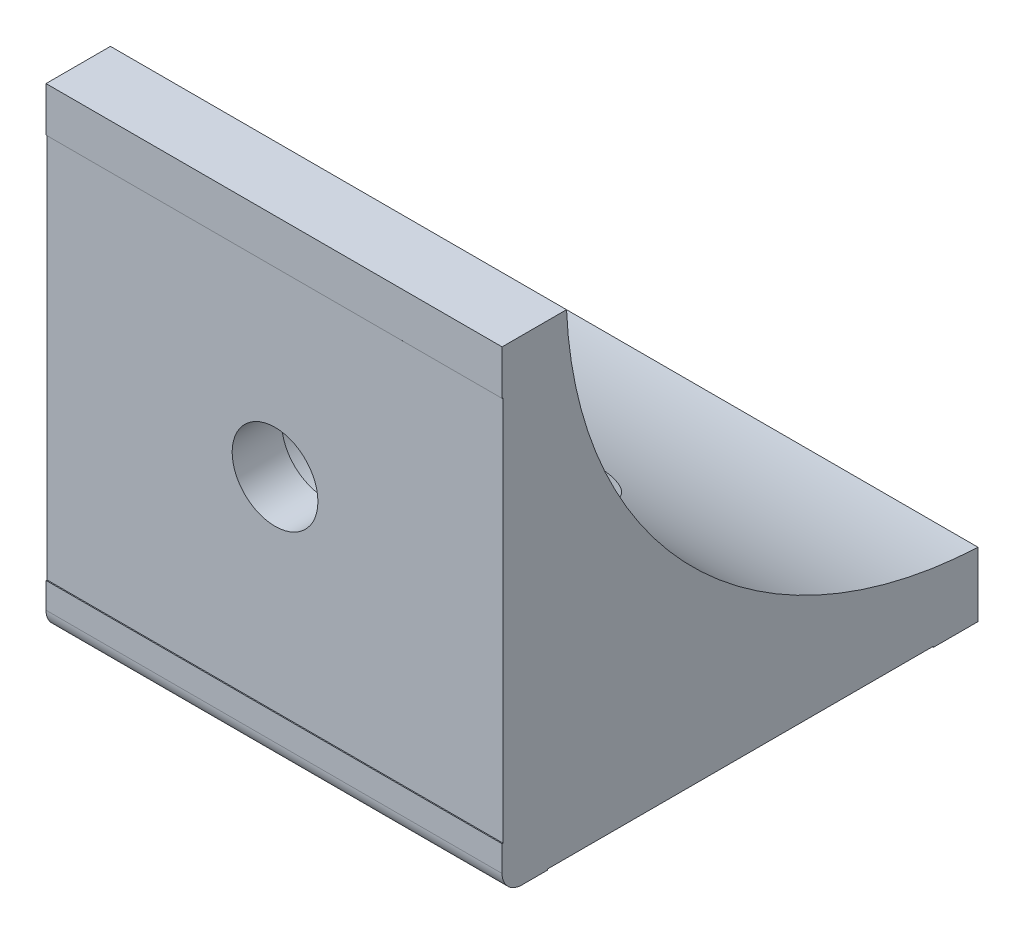
ISO-10303-21;
HEADER;
FILE_DESCRIPTION(('STEP AP214'),'2;1');
FILE_NAME('part.step','',(''),(''),'','','');
FILE_SCHEMA(('AUTOMOTIVE_DESIGN { 1 0 10303 214 1 1 1 1 }'));
ENDSEC;
DATA;
#1=APPLICATION_CONTEXT('core data for automotive mechanical design processes');
#2=APPLICATION_PROTOCOL_DEFINITION('international standard','automotive_design',2000,#1);
#3=PRODUCT_CONTEXT('',#1,'mechanical');
#4=PRODUCT('Part','Part','',(#3));
#5=PRODUCT_RELATED_PRODUCT_CATEGORY('part','',(#4));
#6=PRODUCT_DEFINITION_FORMATION('','',#4);
#7=PRODUCT_DEFINITION_CONTEXT('part definition',#1,'design');
#8=PRODUCT_DEFINITION('design','',#6,#7);
#9=PRODUCT_DEFINITION_SHAPE('','',#8);
#10=(LENGTH_UNIT() NAMED_UNIT(*) SI_UNIT(.MILLI.,.METRE.));
#11=(NAMED_UNIT(*) PLANE_ANGLE_UNIT() SI_UNIT($,.RADIAN.));
#12=(NAMED_UNIT(*) SI_UNIT($,.STERADIAN.) SOLID_ANGLE_UNIT());
#13=UNCERTAINTY_MEASURE_WITH_UNIT(LENGTH_MEASURE(1.E-05),#10,'distance_accuracy_value','');
#14=(GEOMETRIC_REPRESENTATION_CONTEXT(3) GLOBAL_UNCERTAINTY_ASSIGNED_CONTEXT((#13)) GLOBAL_UNIT_ASSIGNED_CONTEXT((#10,
#11,#12)) REPRESENTATION_CONTEXT('',''));
#15=CARTESIAN_POINT('',(0.,0.,0.));
#16=DIRECTION('',(0.,0.,1.));
#17=DIRECTION('',(1.,0.,0.));
#18=AXIS2_PLACEMENT_3D('',#15,#16,#17);
#19=CARTESIAN_POINT('',(23.,0.,0.));
#20=DIRECTION('',(0.,0.,-1.));
#21=DIRECTION('',(-1.,0.,0.));
#22=AXIS2_PLACEMENT_3D('',#19,#20,#21);
#23=PLANE('',#22);
#24=CARTESIAN_POINT('',(0.,25.,0.));
#25=DIRECTION('',(0.,0.,-1.));
#26=DIRECTION('',(0.,1.,0.));
#27=AXIS2_PLACEMENT_3D('',#24,#25,#26);
#28=CIRCLE('',#27,4.325);
#29=CARTESIAN_POINT('',(0.,29.325,0.));
#30=VERTEX_POINT('',#29);
#31=EDGE_CURVE('E213',#30,#30,#28,.T.);
#32=ORIENTED_EDGE('',*,*,#31,.T.);
#33=EDGE_LOOP('',(#32));
#34=FACE_BOUND('',#33,.T.);
#35=DIRECTION('',(-1.,0.,0.));
#36=VECTOR('',#35,1.);
#37=CARTESIAN_POINT('',(-23.,4.5,0.));
#38=LINE('',#37,#36);
#39=CARTESIAN_POINT('',(23.,4.5,0.));
#40=VERTEX_POINT('',#39);
#41=CARTESIAN_POINT('',(-23.,4.5,0.));
#42=VERTEX_POINT('',#41);
#43=EDGE_CURVE('E166',#40,#42,#38,.T.);
#44=ORIENTED_EDGE('',*,*,#43,.F.);
#45=DIRECTION('',(0.,-1.,0.));
#46=VECTOR('',#45,1.);
#47=CARTESIAN_POINT('',(23.,0.,0.));
#48=LINE('',#47,#46);
#49=CARTESIAN_POINT('',(23.,43.4,0.));
#50=VERTEX_POINT('',#49);
#51=EDGE_CURVE('E271',#50,#40,#48,.T.);
#52=ORIENTED_EDGE('',*,*,#51,.F.);
#53=DIRECTION('',(1.,0.,0.));
#54=VECTOR('',#53,1.);
#55=CARTESIAN_POINT('',(-23.,43.4,0.));
#56=LINE('',#55,#54);
#57=CARTESIAN_POINT('',(-23.,43.4,0.));
#58=VERTEX_POINT('',#57);
#59=EDGE_CURVE('E126',#58,#50,#56,.T.);
#60=ORIENTED_EDGE('',*,*,#59,.F.);
#61=DIRECTION('',(0.,-1.,0.));
#62=VECTOR('',#61,1.);
#63=CARTESIAN_POINT('',(-23.,0.,0.));
#64=LINE('',#63,#62);
#65=EDGE_CURVE('E311',#58,#42,#64,.T.);
#66=ORIENTED_EDGE('',*,*,#65,.T.);
#67=EDGE_LOOP('',(#44,#52,#60,#66));
#68=FACE_BOUND('',#67,.T.);
#69=ADVANCED_FACE('F16',(#34,#68),#23,.F.);
#70=CARTESIAN_POINT('',(23.,49.8370158421426,-49.8370158421426));
#71=DIRECTION('',(-1.,0.,0.));
#72=DIRECTION('',(0.,0.,1.));
#73=AXIS2_PLACEMENT_3D('',#70,#71,#72);
#74=CYLINDRICAL_SURFACE('',#73,43.4801837121609);
#75=CARTESIAN_POINT('',(-23.,49.8370158421426,-49.8370158421426));
#76=DIRECTION('',(-1.,0.,0.));
#77=DIRECTION('',(0.,0.,1.));
#78=AXIS2_PLACEMENT_3D('',#75,#76,#77);
#79=CIRCLE('',#78,43.4801837121609);
#80=CARTESIAN_POINT('',(-23.,6.4,-47.9));
#81=VERTEX_POINT('',#80);
#82=CARTESIAN_POINT('',(-23.,47.9,-6.4));
#83=VERTEX_POINT('',#82);
#84=EDGE_CURVE('E312',#81,#83,#79,.T.);
#85=ORIENTED_EDGE('',*,*,#84,.T.);
#86=DIRECTION('',(-1.,0.,0.));
#87=VECTOR('',#86,1.);
#88=CARTESIAN_POINT('',(23.,47.9,-6.4));
#89=LINE('',#88,#87);
#90=CARTESIAN_POINT('',(23.,47.9,-6.4));
#91=VERTEX_POINT('',#90);
#92=EDGE_CURVE('E308',#91,#83,#89,.T.);
#93=ORIENTED_EDGE('',*,*,#92,.F.);
#94=CARTESIAN_POINT('',(23.,49.8370158421426,-49.8370158421426));
#95=DIRECTION('',(-1.,0.,0.));
#96=DIRECTION('',(0.,0.,1.));
#97=AXIS2_PLACEMENT_3D('',#94,#95,#96);
#98=CIRCLE('',#97,43.4801837121609);
#99=CARTESIAN_POINT('',(23.,6.4,-47.9));
#100=VERTEX_POINT('',#99);
#101=EDGE_CURVE('E323',#100,#91,#98,.T.);
#102=ORIENTED_EDGE('',*,*,#101,.F.);
#103=DIRECTION('',(-1.,0.,0.));
#104=VECTOR('',#103,1.);
#105=CARTESIAN_POINT('',(23.,6.4,-47.9));
#106=LINE('',#105,#104);
#107=EDGE_CURVE('E259',#100,#81,#106,.T.);
#108=ORIENTED_EDGE('',*,*,#107,.T.);
#109=EDGE_LOOP('',(#85,#93,#102,#108));
#110=FACE_BOUND('',#109,.T.);
#111=CARTESIAN_POINT('',(0.,17.95,-20.2778447386389));
#112=CARTESIAN_POINT('',(-0.156852133625671,17.9500000287967,-20.2778446995712));
#113=CARTESIAN_POINT('',(-0.313704682230434,17.9552457500528,-20.2721828504309));
#114=CARTESIAN_POINT('',(-0.625909123536725,17.9760966773076,-20.2497138860527));
#115=CARTESIAN_POINT('',(-0.78126098688294,17.9917020855401,-20.232906553241));
#116=CARTESIAN_POINT('',(-1.08920305232275,18.032913687193,-20.1886369412381));
#117=CARTESIAN_POINT('',(-1.24179099094665,18.058527721062,-20.1611663088584));
#118=CARTESIAN_POINT('',(-1.54291865364216,18.1191934438134,-20.0963352428175));
#119=CARTESIAN_POINT('',(-1.69145823393064,18.1542454674195,-20.0589744583972));
#120=CARTESIAN_POINT('',(-1.98225084239021,18.2327510627156,-19.9756685272191));
#121=CARTESIAN_POINT('',(-2.12454880490887,18.2761252087994,-19.9298046625785));
#122=CARTESIAN_POINT('',(-2.40369044251626,18.3707834138897,-19.8302281470525));
#123=CARTESIAN_POINT('',(-2.54053196513077,18.4220705563428,-19.7765124369802));
#124=CARTESIAN_POINT('',(-2.94212672691639,18.5867272824805,-19.6050632335073));
#125=CARTESIAN_POINT('',(-3.19808082616225,18.7109284502344,-19.4769887622774));
#126=CARTESIAN_POINT('',(-3.80480687448833,19.050257256296,-19.1322115280365));
#127=CARTESIAN_POINT('',(-4.14021138915003,19.2800440136265,-18.902920291766));
#128=CARTESIAN_POINT('',(-4.60148146143606,19.6550678657208,-18.5383358020635));
#129=CARTESIAN_POINT('',(-4.7484602109213,19.7853583118506,-18.4131566129299));
#130=CARTESIAN_POINT('',(-5.0287547082574,20.0551107725313,-18.157386347025));
#131=CARTESIAN_POINT('',(-5.16207061348406,20.1945726814101,-18.0267953326143));
#132=CARTESIAN_POINT('',(-5.45186895657431,20.5233274263913,-17.7231934437043));
#133=CARTESIAN_POINT('',(-5.60386722922496,20.715347878082,-17.5488577267903));
#134=CARTESIAN_POINT('',(-5.8856502960148,21.1114650422608,-17.195944916415));
#135=CARTESIAN_POINT('',(-6.01542905320423,21.3155650165,-17.0173666852402));
#136=CARTESIAN_POINT('',(-6.25276826225128,21.7345188233822,-16.657922336038));
#137=CARTESIAN_POINT('',(-6.36032108471071,21.9493763173753,-16.47705545493));
#138=CARTESIAN_POINT('',(-6.55287075208026,22.3885148362486,-16.114809793375));
#139=CARTESIAN_POINT('',(-6.63786964056438,22.6127950052215,-15.9334310608122));
#140=CARTESIAN_POINT('',(-6.78535408209376,23.0712962686899,-15.5702856627198));
#141=CARTESIAN_POINT('',(-6.84766418910448,23.3055798046698,-15.3885264692206));
#142=CARTESIAN_POINT('',(-6.94808984231744,23.7811452847931,-15.0274321284259));
#143=CARTESIAN_POINT('',(-6.98620370037693,24.0224277160131,-14.8480971511192));
#144=CARTESIAN_POINT('',(-7.03723268433063,24.5101827552878,-14.4934346559095));
#145=CARTESIAN_POINT('',(-7.05017354291334,24.7566498025782,-14.3181032268848));
#146=CARTESIAN_POINT('',(-7.04982303237169,25.2531781518364,-13.9726505102806));
#147=CARTESIAN_POINT('',(-7.0365371467519,25.5032386916226,-13.8025281411397));
#148=CARTESIAN_POINT('',(-6.98749062659615,25.9592053911683,-13.4991932906903));
#149=CARTESIAN_POINT('',(-6.95625185708522,26.1648794144037,-13.364890462749));
#150=CARTESIAN_POINT('',(-6.87481413397947,26.5758528872967,-13.1014168228809));
#151=CARTESIAN_POINT('',(-6.82461178347573,26.78115226322,-12.9722469349916));
#152=CARTESIAN_POINT('',(-6.70470669035514,27.1896841293328,-12.719871806282));
#153=CARTESIAN_POINT('',(-6.63500745506929,27.3929169844641,-12.5966654973342));
#154=CARTESIAN_POINT('',(-6.47568818661435,27.795498939029,-12.3569841418899));
#155=CARTESIAN_POINT('',(-6.38607079074711,27.9948485488338,-12.2405082068157));
#156=CARTESIAN_POINT('',(-6.18588215581602,28.3891942175169,-12.014146887423));
#157=CARTESIAN_POINT('',(-6.07515098126832,28.5841434445664,-11.9043208347603));
#158=CARTESIAN_POINT('',(-5.83328209404338,28.9656394472225,-11.6930839115879));
#159=CARTESIAN_POINT('',(-5.70215467855844,29.152190401813,-11.5916688341313));
#160=CARTESIAN_POINT('',(-5.41985225445144,29.5144676500727,-11.3979393317964));
#161=CARTESIAN_POINT('',(-5.26868343139572,29.6901972592255,-11.3056221142255));
#162=CARTESIAN_POINT('',(-4.94702489170949,30.0283058902854,-11.1307164268389));
#163=CARTESIAN_POINT('',(-4.77653875346031,30.190687375243,-11.0481261609436));
#164=CARTESIAN_POINT('',(-4.44174902688932,30.478623350935,-10.9037221823287));
#165=CARTESIAN_POINT('',(-4.27972949193821,30.6061880319527,-10.8406092917689));
#166=CARTESIAN_POINT('',(-3.94317994729388,30.8477964432858,-10.7223892798581));
#167=CARTESIAN_POINT('',(-3.76865174666435,30.9618421224784,-10.6672810043162));
#168=CARTESIAN_POINT('',(-3.40845917002485,31.1748410693577,-10.5653523579114));
#169=CARTESIAN_POINT('',(-3.22280102657001,31.2738026758509,-10.5185274055296));
#170=CARTESIAN_POINT('',(-2.84178171167896,31.4553306887261,-10.433334652111));
#171=CARTESIAN_POINT('',(-2.64642140461869,31.5378985523798,-10.394966099335));
#172=CARTESIAN_POINT('',(-2.269305808803,31.67747700754,-10.3305255483192));
#173=CARTESIAN_POINT('',(-2.0883638802079,31.7362857958359,-10.303572490717));
#174=CARTESIAN_POINT('',(-1.72148357879722,31.8392459558259,-10.256593119413));
#175=CARTESIAN_POINT('',(-1.53554559132959,31.8833984544772,-10.2365662731332));
#176=CARTESIAN_POINT('',(-1.16015374529663,31.9565150238725,-10.203498736659));
#177=CARTESIAN_POINT('',(-0.970700945957483,31.9854835958773,-10.1904559760142));
#178=CARTESIAN_POINT('',(-0.589715201831114,32.0279064809689,-10.1713815467018));
#179=CARTESIAN_POINT('',(-0.398182294442085,32.0413610725163,-10.1653497521942));
#180=CARTESIAN_POINT('',(-0.0239903467593699,32.0523204360617,-10.1604356718422));
#181=CARTESIAN_POINT('',(0.158642802566594,32.0505756844296,-10.1612169867288));
#182=CARTESIAN_POINT('',(0.523084126086777,32.0329341194105,-10.1691302931826));
#183=CARTESIAN_POINT('',(0.704892318546231,32.0170376209069,-10.1762621434472));
#184=CARTESIAN_POINT('',(1.06635478197586,31.971267627016,-10.1968588822417));
#185=CARTESIAN_POINT('',(1.24600929438139,31.9413957136393,-10.2103230539566));
#186=CARTESIAN_POINT('',(1.60191344976246,31.8679973231088,-10.2435521216712));
#187=CARTESIAN_POINT('',(1.77816306505443,31.8244707349851,-10.2633170688766));
#188=CARTESIAN_POINT('',(2.12505610639665,31.7245100799772,-10.308968728204));
#189=CARTESIAN_POINT('',(2.29572548664944,31.6681499802141,-10.3348203869632));
#190=CARTESIAN_POINT('',(2.63141848599899,31.542953390693,-10.392644802074));
#191=CARTESIAN_POINT('',(2.79644018407773,31.4741127049218,-10.4246196172548));
#192=CARTESIAN_POINT('',(3.11970976545431,31.3246829328023,-10.4945870125192));
#193=CARTESIAN_POINT('',(3.27795881188217,31.2440958743259,-10.5325785539843));
#194=CARTESIAN_POINT('',(3.58678650686816,31.071961599928,-10.6144688159792));
#195=CARTESIAN_POINT('',(3.73736466831962,30.9804136892181,-10.6583679109999));
#196=CARTESIAN_POINT('',(4.0346531538191,30.7841844621767,-10.7534100172285));
#197=CARTESIAN_POINT('',(4.18109043063679,30.6791792927628,-10.8047382545526));
#198=CARTESIAN_POINT('',(4.4641575289208,30.459478064301,-10.9133415848928));
#199=CARTESIAN_POINT('',(4.6007869865006,30.344781646035,-10.9706168983626));
#200=CARTESIAN_POINT('',(4.86361187512162,30.1067806388883,-11.0908939085445));
#201=CARTESIAN_POINT('',(4.98980761500628,29.9834763050057,-11.1538954356418));
#202=CARTESIAN_POINT('',(5.23133406775435,29.7293123115308,-11.2853995360696));
#203=CARTESIAN_POINT('',(5.34666092036848,29.5984499940217,-11.3539040479865));
#204=CARTESIAN_POINT('',(5.57401534683741,29.3205738059315,-11.5012826084452));
#205=CARTESIAN_POINT('',(5.68519929879259,29.1730765451367,-11.5805483325842));
#206=CARTESIAN_POINT('',(5.89439995622114,28.8719766631422,-11.7447200763368));
#207=CARTESIAN_POINT('',(5.99241179710467,28.7183718133404,-11.829628162524));
#208=CARTESIAN_POINT('',(6.26645482861684,28.2503203414699,-12.09223553945));
#209=CARTESIAN_POINT('',(6.42261608165731,27.92848482095,-12.2778979203151));
#210=CARTESIAN_POINT('',(6.69750401260337,27.2362229856462,-12.689858279517));
#211=CARTESIAN_POINT('',(6.80965574687745,26.8645380479034,-12.9183668023995));
#212=CARTESIAN_POINT('',(6.9711130620304,26.1188176398894,-13.3929612933016));
#213=CARTESIAN_POINT('',(7.02038940779371,25.7447811573894,-13.6390553819494));
#214=CARTESIAN_POINT('',(7.06279930664877,24.9458921249165,-14.1827617731816));
#215=CARTESIAN_POINT('',(7.04622478170287,24.5219890942904,-14.4825072721807));
#216=CARTESIAN_POINT('',(6.94005690686496,23.6908553898329,-15.0926534167344));
#217=CARTESIAN_POINT('',(6.8503950088103,23.2836407446541,-15.4030638029169));
#218=CARTESIAN_POINT('',(6.65542800695635,22.6624751114756,-15.8936174332544));
#219=CARTESIAN_POINT('',(6.57314481960206,22.440238037673,-16.0727962598814));
#220=CARTESIAN_POINT('',(6.38650053575546,22.0048009128635,-16.4308262836361));
#221=CARTESIAN_POINT('',(6.28213547887723,21.7916024911844,-16.6096774161802));
#222=CARTESIAN_POINT('',(6.05163911123428,21.3755354172986,-16.9653644241815));
#223=CARTESIAN_POINT('',(5.92550698557504,21.1726671521908,-17.1422002239263));
#224=CARTESIAN_POINT('',(5.65152575530012,20.7785868010537,-17.4919480531474));
#225=CARTESIAN_POINT('',(5.5036827063409,20.5873714857347,-17.6648611612733));
#226=CARTESIAN_POINT('',(5.22195651857233,20.2598314367149,-17.9661154555677));
#227=CARTESIAN_POINT('',(5.09246371624649,20.1208643934035,-18.0957019685971));
#228=CARTESIAN_POINT('',(4.82014244701854,19.8516613955943,-18.3498891496752));
#229=CARTESIAN_POINT('',(4.67731407269458,19.7214253804948,-18.4744898523279));
#230=CARTESIAN_POINT('',(4.37833859693755,19.4709312640508,-18.7169643635958));
#231=CARTESIAN_POINT('',(4.22221374976518,19.3506571302328,-18.8348488817455));
#232=CARTESIAN_POINT('',(3.89633881099277,19.1211554872644,-19.0622139234961));
#233=CARTESIAN_POINT('',(3.72658782736494,19.0119287023824,-19.1716938959787));
#234=CARTESIAN_POINT('',(3.29133763498077,18.75828889916,-19.4283843349681));
#235=CARTESIAN_POINT('',(3.01788878043246,18.6209913679083,-19.569602746914));
#236=CARTESIAN_POINT('',(2.58718895349757,18.4400265532406,-19.7577355739897));
#237=CARTESIAN_POINT('',(2.4401891758267,18.3838651751663,-19.8165009875043));
#238=CARTESIAN_POINT('',(2.13978963335064,18.2807010431849,-19.9249622193799));
#239=CARTESIAN_POINT('',(1.98639316504553,18.2336936409465,-19.9746626400701));
#240=CARTESIAN_POINT('',(1.68460339353686,18.1525668028298,-20.060761333373));
#241=CARTESIAN_POINT('',(1.53658045341502,18.1177878267999,-20.0978348618041));
#242=CARTESIAN_POINT('',(1.23660557585795,18.0576167264864,-20.1621424660901));
#243=CARTESIAN_POINT('',(1.08465586476807,18.0322194028542,-20.1893819917977));
#244=CARTESIAN_POINT('',(0.777995827191417,17.9913529889788,-20.2332823291412));
#245=CARTESIAN_POINT('',(0.623287157433132,17.975878133887,-20.2499492832683));
#246=CARTESIAN_POINT('',(0.312385791396352,17.9552016469596,-20.2722304839075));
#247=CARTESIAN_POINT('',(0.156193101447803,17.9499999713243,-20.2778447775425));
#248=CARTESIAN_POINT('',(0.,17.95,-20.2778447386389));
#249=B_SPLINE_CURVE_WITH_KNOTS('',3,(#111,#112,#113,#114,#115,#116,#117,#118,#119,#120,#121,
#122,#123,#124,#125,#126,#127,#128,#129,#130,#131,#132,#133,#134,#135,#136,#137,#138,#139,#140,
#141,#142,#143,#144,#145,#146,#147,#148,#149,#150,#151,#152,#153,#154,#155,#156,#157,#158,#159,
#160,#161,#162,#163,#164,#165,#166,#167,#168,#169,#170,#171,#172,#173,#174,#175,#176,#177,#178,
#179,#180,#181,#182,#183,#184,#185,#186,#187,#188,#189,#190,#191,#192,#193,#194,#195,#196,#197,
#198,#199,#200,#201,#202,#203,#204,#205,#206,#207,#208,#209,#210,#211,#212,#213,#214,#215,#216,
#217,#218,#219,#220,#221,#222,#223,#224,#225,#226,#227,#228,#229,#230,#231,#232,#233,#234,#235,
#236,#237,#238,#239,#240,#241,#242,#243,#244,#245,#246,#247,#248),.UNSPECIFIED.,.T.,.F.,(4,2,2,
2,2,2,2,2,2,2,2,2,2,2,2,2,2,2,2,2,2,2,2,2,2,2,2,2,2,2,2,2,2,2,2,2,2,2,2,2,2,2,2,2,2,2,2,2,2,2,2,
2,2,2,2,2,2,2,2,2,2,2,2,2,2,2,2,2,4),(0.,0.470370238960469,0.940749660404657,1.41149830370167,
1.88226364456705,2.34874143476547,2.81540145795772,3.74830284823619,5.14055115500903,
5.83883949696847,6.53711979477233,7.43778002368517,8.33868457123552,9.23989785648399,
10.1410294564075,11.048988272704,11.9570104292184,12.8641038860849,13.771007707354,
14.5131413511259,15.2554079949239,15.9975411967658,16.7395761935298,17.487473006393,
18.2349934562911,18.982283726771,19.7294357932001,20.3755053334017,21.0214816237205,
21.667099498757,22.3126599578438,22.8884092228424,23.4641142068361,24.0396484269587,
24.6151723166448,25.1624467686232,25.7097090437759,26.2569093840763,26.8041141715246,
27.3482415306491,27.8925521675386,28.43676894671,28.981020241068,29.542488665156,
30.1039779099074,30.6654505283313,31.2271218165899,31.8294648022149,32.4320296312809,
33.6365329541953,34.9828963559621,36.3298855473162,37.8822966302984,39.4361653868781,
40.3266281815815,41.2172508164735,42.1079068008724,42.998314831818,43.6875909860844,
44.3768623556167,45.065001950456,45.7531866307856,46.7599160428425,47.2633580822032,
47.7665438063989,48.2354725401391,48.7041410004381,49.1725369220472,49.6409308466546),.UNSPECIFIED.);
#250=CARTESIAN_POINT('',(-3.84664199033898,19.0918830920368,-19.0918830920368));
#251=VERTEX_POINT('',#250);
#252=CARTESIAN_POINT('',(3.84664199033899,19.0918830920368,-19.0918830920368));
#253=VERTEX_POINT('',#252);
#254=EDGE_CURVE('E206',#251,#253,#249,.T.);
#255=ORIENTED_EDGE('',*,*,#254,.F.);
#256=CARTESIAN_POINT('',(0.,10.1614762355459,-32.05));
#257=CARTESIAN_POINT('',(0.183707570233541,10.1614765002818,-32.0499987505087));
#258=CARTESIAN_POINT('',(0.367452895787242,10.1646968068717,-32.0428108166061));
#259=CARTESIAN_POINT('',(0.733671539090991,10.1775746022229,-32.0141278614933));
#260=CARTESIAN_POINT('',(0.916144144047546,10.1872354447676,-31.9926253862736));
#261=CARTESIAN_POINT('',(1.27876464921499,10.2129991040001,-31.9354891844208));
#262=CARTESIAN_POINT('',(1.45890745016847,10.2291141756085,-31.8998285762627));
#263=CARTESIAN_POINT('',(1.81522131582155,10.267747038486,-31.8147651407949));
#264=CARTESIAN_POINT('',(1.99139221887985,10.2902650898265,-31.7653617552932));
#265=CARTESIAN_POINT('',(2.33815911060063,10.3415891323124,-31.6534677553645));
#266=CARTESIAN_POINT('',(2.50876619266579,10.3703816040233,-31.5910052907835));
#267=CARTESIAN_POINT('',(2.84366710223569,10.4342018238766,-31.4535896750908));
#268=CARTESIAN_POINT('',(3.0079607555849,10.4692297438734,-31.3786361797187));
#269=CARTESIAN_POINT('',(3.32908786283742,10.5453887573039,-31.217070026018));
#270=CARTESIAN_POINT('',(3.48592621880274,10.5865157650156,-31.1304651764001));
#271=CARTESIAN_POINT('',(3.79139461482677,10.6747723623659,-30.9463970605285));
#272=CARTESIAN_POINT('',(3.94002173095623,10.7219040707099,-30.8489299631545));
#273=CARTESIAN_POINT('',(4.23175430963142,10.8232270963472,-30.6415920069369));
#274=CARTESIAN_POINT('',(4.37463469694004,10.8775632986905,-30.5314754146525));
#275=CARTESIAN_POINT('',(4.65022137998255,10.9921706663957,-30.3018976887347));
#276=CARTESIAN_POINT('',(4.78292399409678,11.0524439615486,-30.1824332049504));
#277=CARTESIAN_POINT('',(5.03752145634532,11.1786666273633,-29.9353161083602));
#278=CARTESIAN_POINT('',(5.15941764459328,11.2446152922131,-29.8076645142378));
#279=CARTESIAN_POINT('',(5.39204433283001,11.3819539953322,-29.545230767352));
#280=CARTESIAN_POINT('',(5.50277061646725,11.4533460706267,-29.4104459510332));
#281=CARTESIAN_POINT('',(5.72089542709534,11.6070229780275,-29.124160079872));
#282=CARTESIAN_POINT('',(5.82736609630736,11.6897231546718,-28.9721740741668));
#283=CARTESIAN_POINT('',(6.02678939578838,11.8607113949627,-28.6625490772928));
#284=CARTESIAN_POINT('',(6.1197370241852,11.9490015089615,-28.5049080211852));
#285=CARTESIAN_POINT('',(6.37815730543464,12.2216457882312,-28.0254369726668));
#286=CARTESIAN_POINT('',(6.52332012702878,12.4138539604889,-27.6969088367289));
#287=CARTESIAN_POINT('',(6.77472104453422,12.8402015649167,-26.9907368358259));
#288=CARTESIAN_POINT('',(6.87399888814989,13.0765923027592,-26.6120120164315));
#289=CARTESIAN_POINT('',(7.00863073491224,13.5663857754743,-25.8542797088584));
#290=CARTESIAN_POINT('',(7.04395588612162,13.8197961352246,-25.475272170231));
#291=CARTESIAN_POINT('',(7.05544688624943,14.3789888598874,-24.66695632081));
#292=CARTESIAN_POINT('',(7.02162346061193,14.6868115302799,-24.2389292134322));
#293=CARTESIAN_POINT('',(6.87961296760577,15.3118824710497,-23.4019128542899));
#294=CARTESIAN_POINT('',(6.77134588283664,15.6291405318524,-22.9929445939085));
#295=CARTESIAN_POINT('',(6.54632077627984,16.1281009570364,-22.372137773809));
#296=CARTESIAN_POINT('',(6.45321898300773,16.3094494378527,-22.1511312018296));
#297=CARTESIAN_POINT('',(6.24455972714239,16.6711046197277,-21.718908290398));
#298=CARTESIAN_POINT('',(6.12899776517842,16.8514111045819,-21.5076939231033));
#299=CARTESIAN_POINT('',(5.87567126174323,17.2090600840378,-21.096501756221));
#300=CARTESIAN_POINT('',(5.7379136032994,17.3864034787561,-20.8965204990187));
#301=CARTESIAN_POINT('',(5.44011093693517,17.7360321639283,-20.5091925970141));
#302=CARTESIAN_POINT('',(5.28007394600832,17.9083192469627,-20.3218414432307));
#303=CARTESIAN_POINT('',(4.98424832558147,18.1991620015417,-20.0107738190471));
#304=CARTESIAN_POINT('',(4.85379708871086,18.3195269095115,-19.88366644126));
#305=CARTESIAN_POINT('',(4.58081804547171,18.5549526707605,-19.637877695929));
#306=CARTESIAN_POINT('',(4.43829066537176,18.6700137110367,-19.5191960312424));
#307=CARTESIAN_POINT('',(3.99266885973872,19.004827328594,-19.1775410824479));
#308=CARTESIAN_POINT('',(3.67093742066127,19.2148129395264,-18.9683185215351));
#309=CARTESIAN_POINT('',(3.06519862249298,19.5453020485189,-18.6444179095037));
#310=CARTESIAN_POINT('',(2.791952934094,19.6750412542413,-18.5191871326217));
#311=CARTESIAN_POINT('',(2.363301717107,19.845552403249,-18.3561536788473));
#312=CARTESIAN_POINT('',(2.21731742561657,19.8983653309969,-18.3059519203431));
#313=CARTESIAN_POINT('',(1.91959168567228,19.9948890960536,-18.2145828449638));
#314=CARTESIAN_POINT('',(1.76785110743076,20.0386013027411,-18.173414168837));
#315=CARTESIAN_POINT('',(1.48229409669536,20.1101239254412,-18.1062687540743));
#316=CARTESIAN_POINT('',(1.34914198919114,20.1393296031547,-18.0789461089418));
#317=CARTESIAN_POINT('',(1.08002013726251,20.1897418226315,-18.031879280349));
#318=CARTESIAN_POINT('',(0.944050889078033,20.2109497607712,-18.0121337739374));
#319=CARTESIAN_POINT('',(0.67020148947333,20.2448862583853,-17.9805756506983));
#320=CARTESIAN_POINT('',(0.532322204007256,20.2576185398182,-17.9687595517713));
#321=CARTESIAN_POINT('',(0.255571828890037,20.2743142827645,-17.9532710281419));
#322=CARTESIAN_POINT('',(0.116700726658411,20.2782776328514,-17.9495987069223));
#323=CARTESIAN_POINT('',(-0.161126718175452,20.277336345134,-17.9504712807862));
#324=CARTESIAN_POINT('',(-0.300083003681186,20.2724226775998,-17.9550245429584));
#325=CARTESIAN_POINT('',(-0.576894428567612,20.2538314696064,-17.9722745583743));
#326=CARTESIAN_POINT('',(-0.714749564469544,20.2401539014712,-17.9849713373348));
#327=CARTESIAN_POINT('',(-0.988413030669495,20.2043578503889,-18.0182705674418));
#328=CARTESIAN_POINT('',(-1.12422093588068,20.182237638839,-18.0388746375843));
#329=CARTESIAN_POINT('',(-1.39296632183071,20.1300404414016,-18.0876337933848));
#330=CARTESIAN_POINT('',(-1.52590260443653,20.0999602011359,-18.1157919675276));
#331=CARTESIAN_POINT('',(-1.78827511209352,20.0324260577844,-18.1792371795514));
#332=CARTESIAN_POINT('',(-1.91770805202301,19.9949654891656,-18.2145306624358));
#333=CARTESIAN_POINT('',(-2.17244397567826,19.913358457921,-18.291742780459));
#334=CARTESIAN_POINT('',(-2.29774565156021,19.8692099023454,-18.3336634897126));
#335=CARTESIAN_POINT('',(-2.66679675177403,19.7277905869096,-18.4685930709636));
#336=CARTESIAN_POINT('',(-2.90378353857502,19.6215218855227,-18.5707920164177));
#337=CARTESIAN_POINT('',(-3.48896105161065,19.3236417001209,-18.8608243932264));
#338=CARTESIAN_POINT('',(-3.82249391612924,19.1181496253825,-19.0640592929228));
#339=CARTESIAN_POINT('',(-4.28503597084641,18.7879416676196,-19.3984485728414));
#340=CARTESIAN_POINT('',(-4.4331453863274,18.6739961298071,-19.5150601814331));
#341=CARTESIAN_POINT('',(-4.71701221130314,18.4402218147256,-19.7571900107004));
#342=CARTESIAN_POINT('',(-4.85276979661199,18.3203931212339,-19.882708104557));
#343=CARTESIAN_POINT('',(-5.15446239781249,18.0363099350871,-20.1840691592976));
#344=CARTESIAN_POINT('',(-5.31574950467038,17.8703410823774,-20.3629470951754));
#345=CARTESIAN_POINT('',(-5.61717824013738,17.5330088767765,-20.7330599281004));
#346=CARTESIAN_POINT('',(-5.75731326522328,17.3616438593396,-20.9242986575932));
#347=CARTESIAN_POINT('',(-6.01655724841689,17.0155914763337,-21.3177394239709));
#348=CARTESIAN_POINT('',(-6.13566333102554,16.840903660017,-21.5199429552499));
#349=CARTESIAN_POINT('',(-6.35272926256588,16.4899738700133,-21.9340620531424));
#350=CARTESIAN_POINT('',(-6.45069100845322,16.3137320372222,-22.1459767464534));
#351=CARTESIAN_POINT('',(-6.62619696456099,15.9590813662686,-22.5809777842431));
#352=CARTESIAN_POINT('',(-6.70348465514557,15.7806716697361,-22.8041669755051));
#353=CARTESIAN_POINT('',(-6.83552400616859,15.4251852710439,-23.2581630955508));
#354=CARTESIAN_POINT('',(-6.89027509235276,15.2481086029639,-23.4889702182849));
#355=CARTESIAN_POINT('',(-6.97647662085874,14.8965590399237,-23.9569747824194));
#356=CARTESIAN_POINT('',(-7.00791956686252,14.7220870003217,-24.1941742543173));
#357=CARTESIAN_POINT('',(-7.04653042561597,14.3771102034411,-24.6733790967678));
#358=CARTESIAN_POINT('',(-7.05370055060257,14.2066050860222,-24.9153840273264));
#359=CARTESIAN_POINT('',(-7.04257395524861,13.8664736859077,-25.4087834017597));
#360=CARTESIAN_POINT('',(-7.02361284137509,13.6969845387308,-25.6602586956215));
#361=CARTESIAN_POINT('',(-6.95785028204802,13.3648932003485,-26.1642107962334));
#362=CARTESIAN_POINT('',(-6.91104561728311,13.2022918078442,-26.4166877154392));
#363=CARTESIAN_POINT('',(-6.78859203904216,12.8856905154295,-26.9194669971556));
#364=CARTESIAN_POINT('',(-6.71299157277978,12.7316766637227,-27.1697722937748));
#365=CARTESIAN_POINT('',(-6.5320588929746,12.4334304139695,-27.6653738487889));
#366=CARTESIAN_POINT('',(-6.42674002176222,12.2891936623695,-27.9106723021733));
#367=CARTESIAN_POINT('',(-6.22122425216319,12.0525515346757,-28.3219199105388));
#368=CARTESIAN_POINT('',(-6.1285694758544,11.9573429207254,-28.4900582578712));
#369=CARTESIAN_POINT('',(-5.92816965187785,11.7729850132588,-28.8205533180753));
#370=CARTESIAN_POINT('',(-5.82042765233153,11.6838345011945,-28.9829111905057));
#371=CARTESIAN_POINT('',(-5.59006084623252,11.5120871973575,-29.3002495728767));
#372=CARTESIAN_POINT('',(-5.46744307789771,11.4294873366108,-29.4552335237139));
#373=CARTESIAN_POINT('',(-5.20764097468752,11.2712193697173,-29.756312517539));
#374=CARTESIAN_POINT('',(-5.07045604884263,11.1955515450257,-29.9024071995229));
#375=CARTESIAN_POINT('',(-4.78139144715696,11.0511833335114,-30.18476792057));
#376=CARTESIAN_POINT('',(-4.62944167315373,10.982519706904,-30.3209811182582));
#377=CARTESIAN_POINT('',(-4.31228562143995,10.8529492286777,-30.5811064336896));
#378=CARTESIAN_POINT('',(-4.14708035297521,10.7920417874308,-30.7050194863361));
#379=CARTESIAN_POINT('',(-3.80443630434252,10.6782540184489,-30.9390082899295));
#380=CARTESIAN_POINT('',(-3.62699285500709,10.6253767793454,-31.0490787138457));
#381=CARTESIAN_POINT('',(-3.26128817492759,10.5279268376137,-31.2538308792473));
#382=CARTESIAN_POINT('',(-3.07302839217226,10.4833530267742,-31.3485146740824));
#383=CARTESIAN_POINT('',(-2.70517248404078,10.4064401196917,-31.5131639433297));
#384=CARTESIAN_POINT('',(-2.52639336817344,10.3733495446056,-31.584607803785));
#385=CARTESIAN_POINT('',(-2.16254675329436,10.3142633090446,-31.712904765848));
#386=CARTESIAN_POINT('',(-1.97747993917005,10.2882668786086,-31.7697594508481));
#387=CARTESIAN_POINT('',(-1.60292631383401,10.2434978333861,-31.8680809659738));
#388=CARTESIAN_POINT('',(-1.41345092652421,10.2247083662273,-31.9095836860996));
#389=CARTESIAN_POINT('',(-1.03124620057565,10.1943272432033,-31.9768649595714));
#390=CARTESIAN_POINT('',(-0.838518833403703,10.1827313767269,-32.0026527111613));
#391=CARTESIAN_POINT('',(-0.537814968712504,10.1703213256556,-32.0302805387283));
#392=CARTESIAN_POINT('',(-0.430417932509644,10.1670049071078,-32.0376721283451));
#393=CARTESIAN_POINT('',(-0.215351588378684,10.1625822837428,-32.0475322267891));
#394=CARTESIAN_POINT('',(-0.10768228027295,10.1614760803679,-32.0500007324035));
#395=CARTESIAN_POINT('',(0.,10.1614762355459,-32.05));
#396=B_SPLINE_CURVE_WITH_KNOTS('',3,(#256,#257,#258,#259,#260,#261,#262,#263,#264,#265,#266,
#267,#268,#269,#270,#271,#272,#273,#274,#275,#276,#277,#278,#279,#280,#281,#282,#283,#284,#285,
#286,#287,#288,#289,#290,#291,#292,#293,#294,#295,#296,#297,#298,#299,#300,#301,#302,#303,#304,
#305,#306,#307,#308,#309,#310,#311,#312,#313,#314,#315,#316,#317,#318,#319,#320,#321,#322,#323,
#324,#325,#326,#327,#328,#329,#330,#331,#332,#333,#334,#335,#336,#337,#338,#339,#340,#341,#342,
#343,#344,#345,#346,#347,#348,#349,#350,#351,#352,#353,#354,#355,#356,#357,#358,#359,#360,#361,
#362,#363,#364,#365,#366,#367,#368,#369,#370,#371,#372,#373,#374,#375,#376,#377,#378,#379,#380,
#381,#382,#383,#384,#385,#386,#387,#388,#389,#390,#391,#392,#393,#394,#395),.UNSPECIFIED.,.T.,
.F.,(4,2,2,2,2,2,2,2,2,2,2,2,2,2,2,2,2,2,2,2,2,2,2,2,2,2,2,2,2,2,2,2,2,2,2,2,2,2,2,2,2,2,2,2,2,
2,2,2,2,2,2,2,2,2,2,2,2,2,2,2,2,2,2,2,2,2,2,2,2,4),(0.,0.551019886379662,1.10232692995384,
1.65468576440611,2.20706703735826,2.75826966497745,3.30948748658757,3.86033770670205,
4.41138283053224,4.97595356326754,5.54072756505581,6.10543143050226,6.67034766571329,
7.2791800171847,7.88823699280629,9.10574460238202,10.4726194913562,11.8401108855766,
13.4189956550145,14.9995801818186,15.9007227614358,16.8020460503581,17.703090369229,
18.6038112904395,19.2582107648518,19.9125871496221,21.2181824834022,22.1964849387271,
22.685448036841,23.1743375077738,23.5909915392686,24.0075727907668,24.4239709859239,
24.8403744722057,25.2572017639163,25.674030371951,26.0909443700647,26.5080290833498,
26.9254922273172,27.3430862838091,28.1779857437201,29.4942245317652,30.1546150128276,
30.8149960925198,31.6913162188326,32.5679093624487,33.4446222787946,34.3212565084724,
35.2083102995186,36.0953866921462,36.9827482608968,37.8700289528972,38.7802899554674,
39.6906562241834,40.5994975735007,41.5079315382069,42.1501728376901,42.7922845697522,
43.4340936737459,44.0759288250054,44.7209757553128,45.3659736196063,46.0112189424903,
46.6563780863748,47.2416729982397,47.8269043599813,48.4107587822525,48.9942711353293,
49.3172574937295,49.640244062904),.UNSPECIFIED.);
#397=EDGE_CURVE('E244',#251,#253,#396,.T.);
#398=ORIENTED_EDGE('',*,*,#397,.T.);
#399=EDGE_LOOP('',(#255,#398));
#400=FACE_BOUND('',#399,.T.);
#401=ADVANCED_FACE('F215',(#110,#400),#74,.F.);
#402=CARTESIAN_POINT('',(0.,47.9,-25.));
#403=DIRECTION('',(0.,-1.,0.));
#404=DIRECTION('',(0.,0.,-1.));
#405=AXIS2_PLACEMENT_3D('',#402,#403,#404);
#406=CYLINDRICAL_SURFACE('',#405,7.05);
#407=CARTESIAN_POINT('',(0.,5.,-25.));
#408=DIRECTION('',(0.,-1.,0.));
#409=DIRECTION('',(0.,0.,-1.));
#410=AXIS2_PLACEMENT_3D('',#407,#408,#409);
#411=CIRCLE('',#410,7.05);
#412=CARTESIAN_POINT('',(0.,5.,-32.05));
#413=VERTEX_POINT('',#412);
#414=EDGE_CURVE('E347',#413,#413,#411,.T.);
#415=ORIENTED_EDGE('',*,*,#414,.T.);
#416=EDGE_LOOP('',(#415));
#417=FACE_BOUND('',#416,.T.);
#418=CARTESIAN_POINT('',(0.,25.,-25.));
#419=DIRECTION('',(0.,-0.707106781186547,-0.707106781186548));
#420=DIRECTION('',(0.,-0.707106781186548,0.707106781186547));
#421=AXIS2_PLACEMENT_3D('',#418,#419,#420);
#422=ELLIPSE('',#421,9.97020561473032,7.05);
#423=EDGE_CURVE('E256',#253,#251,#422,.T.);
#424=ORIENTED_EDGE('',*,*,#423,.F.);
#425=ORIENTED_EDGE('',*,*,#397,.F.);
#426=EDGE_LOOP('',(#424,#425));
#427=FACE_BOUND('',#426,.T.);
#428=ADVANCED_FACE('F236',(#417,#427),#406,.F.);
#429=CARTESIAN_POINT('',(23.,0.,0.));
#430=DIRECTION('',(0.,1.,0.));
#431=DIRECTION('',(0.,0.,1.));
#432=AXIS2_PLACEMENT_3D('',#429,#430,#431);
#433=PLANE('',#432);
#434=CARTESIAN_POINT('',(0.,0.,-25.));
#435=DIRECTION('',(0.,-1.,0.));
#436=DIRECTION('',(0.,0.,-1.));
#437=AXIS2_PLACEMENT_3D('',#434,#435,#436);
#438=CIRCLE('',#437,4.325);
#439=CARTESIAN_POINT('',(0.,0.,-29.325));
#440=VERTEX_POINT('',#439);
#441=EDGE_CURVE('E251',#440,#440,#438,.T.);
#442=ORIENTED_EDGE('',*,*,#441,.F.);
#443=EDGE_LOOP('',(#442));
#444=FACE_BOUND('',#443,.T.);
#445=DIRECTION('',(0.,0.,-1.));
#446=VECTOR('',#445,1.);
#447=CARTESIAN_POINT('',(23.,0.,0.));
#448=LINE('',#447,#446);
#449=CARTESIAN_POINT('',(23.,0.,-4.5));
#450=VERTEX_POINT('',#449);
#451=CARTESIAN_POINT('',(23.,0.,-43.4));
#452=VERTEX_POINT('',#451);
#453=EDGE_CURVE('E335',#450,#452,#448,.T.);
#454=ORIENTED_EDGE('',*,*,#453,.F.);
#455=DIRECTION('',(-1.,0.,0.));
#456=VECTOR('',#455,1.);
#457=CARTESIAN_POINT('',(-23.,0.,-4.5));
#458=LINE('',#457,#456);
#459=CARTESIAN_POINT('',(-23.,0.,-4.5));
#460=VERTEX_POINT('',#459);
#461=EDGE_CURVE('E142',#450,#460,#458,.T.);
#462=ORIENTED_EDGE('',*,*,#461,.T.);
#463=DIRECTION('',(0.,0.,-1.));
#464=VECTOR('',#463,1.);
#465=CARTESIAN_POINT('',(-23.,0.,0.));
#466=LINE('',#465,#464);
#467=CARTESIAN_POINT('',(-23.,0.,-43.4));
#468=VERTEX_POINT('',#467);
#469=EDGE_CURVE('E133',#460,#468,#466,.T.);
#470=ORIENTED_EDGE('',*,*,#469,.T.);
#471=DIRECTION('',(1.,0.,0.));
#472=VECTOR('',#471,1.);
#473=CARTESIAN_POINT('',(-23.,0.,-43.4));
#474=LINE('',#473,#472);
#475=EDGE_CURVE('E137',#468,#452,#474,.T.);
#476=ORIENTED_EDGE('',*,*,#475,.T.);
#477=EDGE_LOOP('',(#454,#462,#470,#476));
#478=FACE_BOUND('',#477,.T.);
#479=ADVANCED_FACE('F240',(#444,#478),#433,.F.);
#480=CARTESIAN_POINT('',(23.,0.,-47.9));
#481=DIRECTION('',(0.,0.,1.));
#482=DIRECTION('',(1.,0.,0.));
#483=AXIS2_PLACEMENT_3D('',#480,#481,#482);
#484=PLANE('',#483);
#485=DIRECTION('',(0.,1.,0.));
#486=VECTOR('',#485,1.);
#487=CARTESIAN_POINT('',(-23.,0.,-47.9));
#488=LINE('',#487,#486);
#489=CARTESIAN_POINT('',(-23.,-0.0999999999999894,-47.9));
#490=VERTEX_POINT('',#489);
#491=EDGE_CURVE('E331',#490,#81,#488,.T.);
#492=ORIENTED_EDGE('',*,*,#491,.T.);
#493=ORIENTED_EDGE('',*,*,#107,.F.);
#494=DIRECTION('',(0.,1.,0.));
#495=VECTOR('',#494,1.);
#496=CARTESIAN_POINT('',(23.,0.,-47.9));
#497=LINE('',#496,#495);
#498=CARTESIAN_POINT('',(23.,-0.0999999999999894,-47.9));
#499=VERTEX_POINT('',#498);
#500=EDGE_CURVE('E326',#499,#100,#497,.T.);
#501=ORIENTED_EDGE('',*,*,#500,.F.);
#502=DIRECTION('',(-1.,0.,0.));
#503=VECTOR('',#502,1.);
#504=CARTESIAN_POINT('',(-23.,-0.0999999999999894,-47.9));
#505=LINE('',#504,#503);
#506=EDGE_CURVE('E150',#499,#490,#505,.T.);
#507=ORIENTED_EDGE('',*,*,#506,.T.);
#508=EDGE_LOOP('',(#492,#493,#501,#507));
#509=FACE_BOUND('',#508,.T.);
#510=ADVANCED_FACE('F295',(#509),#484,.F.);
#511=CARTESIAN_POINT('',(23.,47.9,0.));
#512=DIRECTION('',(0.,-1.,0.));
#513=DIRECTION('',(0.,0.,-1.));
#514=AXIS2_PLACEMENT_3D('',#511,#512,#513);
#515=PLANE('',#514);
#516=DIRECTION('',(0.,0.,1.));
#517=VECTOR('',#516,1.);
#518=CARTESIAN_POINT('',(-23.,47.9,0.));
#519=LINE('',#518,#517);
#520=CARTESIAN_POINT('',(-23.,47.9,0.1));
#521=VERTEX_POINT('',#520);
#522=EDGE_CURVE('E305',#83,#521,#519,.T.);
#523=ORIENTED_EDGE('',*,*,#522,.T.);
#524=DIRECTION('',(-1.,0.,0.));
#525=VECTOR('',#524,1.);
#526=CARTESIAN_POINT('',(-23.,47.9,0.1));
#527=LINE('',#526,#525);
#528=CARTESIAN_POINT('',(23.,47.9,0.1));
#529=VERTEX_POINT('',#528);
#530=EDGE_CURVE('E191',#529,#521,#527,.T.);
#531=ORIENTED_EDGE('',*,*,#530,.F.);
#532=DIRECTION('',(0.,0.,1.));
#533=VECTOR('',#532,1.);
#534=CARTESIAN_POINT('',(23.,47.9,0.));
#535=LINE('',#534,#533);
#536=EDGE_CURVE('E321',#91,#529,#535,.T.);
#537=ORIENTED_EDGE('',*,*,#536,.F.);
#538=ORIENTED_EDGE('',*,*,#92,.T.);
#539=EDGE_LOOP('',(#523,#531,#537,#538));
#540=FACE_BOUND('',#539,.T.);
#541=ADVANCED_FACE('F293',(#540),#515,.F.);
#542=CARTESIAN_POINT('',(23.,49.8370158421426,-49.8370158421426));
#543=DIRECTION('',(-1.,0.,0.));
#544=DIRECTION('',(0.,0.,1.));
#545=AXIS2_PLACEMENT_3D('',#542,#543,#544);
#546=PLANE('',#545);
#547=DIRECTION('',(0.,1.,0.));
#548=VECTOR('',#547,1.);
#549=CARTESIAN_POINT('',(23.,0.,0.1));
#550=LINE('',#549,#548);
#551=CARTESIAN_POINT('',(23.,1.9,0.1));
#552=VERTEX_POINT('',#551);
#553=CARTESIAN_POINT('',(23.,4.5,0.1));
#554=VERTEX_POINT('',#553);
#555=EDGE_CURVE('E170',#552,#554,#550,.T.);
#556=ORIENTED_EDGE('',*,*,#555,.F.);
#557=CARTESIAN_POINT('',(23.,1.9,-1.9));
#558=DIRECTION('',(-1.,0.,0.));
#559=DIRECTION('',(0.,0.,1.));
#560=AXIS2_PLACEMENT_3D('',#557,#558,#559);
#561=CIRCLE('',#560,2.);
#562=CARTESIAN_POINT('',(23.,-0.100000000000003,-1.9));
#563=VERTEX_POINT('',#562);
#564=EDGE_CURVE('E38',#552,#563,#561,.F.);
#565=ORIENTED_EDGE('',*,*,#564,.T.);
#566=DIRECTION('',(0.,0.,-1.));
#567=VECTOR('',#566,1.);
#568=CARTESIAN_POINT('',(23.,-0.100000000000003,0.1));
#569=LINE('',#568,#567);
#570=CARTESIAN_POINT('',(23.,-0.099999999999999,-4.5));
#571=VERTEX_POINT('',#570);
#572=EDGE_CURVE('E127',#563,#571,#569,.T.);
#573=ORIENTED_EDGE('',*,*,#572,.T.);
#574=DIRECTION('',(0.,1.,0.));
#575=VECTOR('',#574,1.);
#576=CARTESIAN_POINT('',(23.,-0.099999999999999,-4.5));
#577=LINE('',#576,#575);
#578=EDGE_CURVE('E138',#571,#450,#577,.T.);
#579=ORIENTED_EDGE('',*,*,#578,.T.);
#580=ORIENTED_EDGE('',*,*,#453,.T.);
#581=DIRECTION('',(0.,1.,0.));
#582=VECTOR('',#581,1.);
#583=CARTESIAN_POINT('',(23.,-0.0999999999999904,-43.4));
#584=LINE('',#583,#582);
#585=CARTESIAN_POINT('',(23.,-0.0999999999999904,-43.4));
#586=VERTEX_POINT('',#585);
#587=EDGE_CURVE('E163',#586,#452,#584,.T.);
#588=ORIENTED_EDGE('',*,*,#587,.F.);
#589=DIRECTION('',(0.,0.,-1.));
#590=VECTOR('',#589,1.);
#591=CARTESIAN_POINT('',(23.,-0.0999999999999894,-47.9));
#592=LINE('',#591,#590);
#593=EDGE_CURVE('E153',#586,#499,#592,.T.);
#594=ORIENTED_EDGE('',*,*,#593,.T.);
#595=ORIENTED_EDGE('',*,*,#500,.T.);
#596=ORIENTED_EDGE('',*,*,#101,.T.);
#597=ORIENTED_EDGE('',*,*,#536,.T.);
#598=DIRECTION('',(0.,1.,0.));
#599=VECTOR('',#598,1.);
#600=CARTESIAN_POINT('',(23.,47.9,0.1));
#601=LINE('',#600,#599);
#602=CARTESIAN_POINT('',(23.,43.4,0.1));
#603=VERTEX_POINT('',#602);
#604=EDGE_CURVE('E188',#603,#529,#601,.T.);
#605=ORIENTED_EDGE('',*,*,#604,.F.);
#606=DIRECTION('',(0.,0.,-1.));
#607=VECTOR('',#606,1.);
#608=CARTESIAN_POINT('',(23.,43.4,0.1));
#609=LINE('',#608,#607);
#610=EDGE_CURVE('E194',#603,#50,#609,.T.);
#611=ORIENTED_EDGE('',*,*,#610,.T.);
#612=ORIENTED_EDGE('',*,*,#51,.T.);
#613=DIRECTION('',(0.,0.,-1.));
#614=VECTOR('',#613,1.);
#615=CARTESIAN_POINT('',(23.,4.5,0.1));
#616=LINE('',#615,#614);
#617=EDGE_CURVE('E179',#554,#40,#616,.T.);
#618=ORIENTED_EDGE('',*,*,#617,.F.);
#619=EDGE_LOOP('',(#556,#565,#573,#579,#580,#588,#594,#595,#596,#597,#605,#611,#612,#618));
#620=FACE_BOUND('',#619,.T.);
#621=ADVANCED_FACE('F268',(#620),#546,.F.);
#622=CARTESIAN_POINT('',(-23.,49.8370158421426,-49.8370158421426));
#623=DIRECTION('',(-1.,0.,0.));
#624=DIRECTION('',(0.,0.,1.));
#625=AXIS2_PLACEMENT_3D('',#622,#623,#624);
#626=PLANE('',#625);
#627=DIRECTION('',(0.,0.,-1.));
#628=VECTOR('',#627,1.);
#629=CARTESIAN_POINT('',(-23.,-0.100000000000003,0.1));
#630=LINE('',#629,#628);
#631=CARTESIAN_POINT('',(-23.,-0.100000000000003,-1.9));
#632=VERTEX_POINT('',#631);
#633=CARTESIAN_POINT('',(-23.,-0.099999999999999,-4.5));
#634=VERTEX_POINT('',#633);
#635=EDGE_CURVE('E119',#632,#634,#630,.T.);
#636=ORIENTED_EDGE('',*,*,#635,.F.);
#637=CARTESIAN_POINT('',(-23.,1.9,-1.9));
#638=DIRECTION('',(-1.,0.,0.));
#639=DIRECTION('',(0.,0.,1.));
#640=AXIS2_PLACEMENT_3D('',#637,#638,#639);
#641=CIRCLE('',#640,2.);
#642=CARTESIAN_POINT('',(-23.,1.9,0.1));
#643=VERTEX_POINT('',#642);
#644=EDGE_CURVE('E10',#632,#643,#641,.T.);
#645=ORIENTED_EDGE('',*,*,#644,.T.);
#646=DIRECTION('',(0.,-1.,0.));
#647=VECTOR('',#646,1.);
#648=CARTESIAN_POINT('',(-23.,0.,0.1));
#649=LINE('',#648,#647);
#650=CARTESIAN_POINT('',(-23.,4.5,0.1));
#651=VERTEX_POINT('',#650);
#652=EDGE_CURVE('E167',#651,#643,#649,.T.);
#653=ORIENTED_EDGE('',*,*,#652,.F.);
#654=DIRECTION('',(0.,0.,-1.));
#655=VECTOR('',#654,1.);
#656=CARTESIAN_POINT('',(-23.,4.5,0.1));
#657=LINE('',#656,#655);
#658=EDGE_CURVE('E174',#651,#42,#657,.T.);
#659=ORIENTED_EDGE('',*,*,#658,.T.);
#660=ORIENTED_EDGE('',*,*,#65,.F.);
#661=DIRECTION('',(0.,0.,-1.));
#662=VECTOR('',#661,1.);
#663=CARTESIAN_POINT('',(-23.,43.4,0.1));
#664=LINE('',#663,#662);
#665=CARTESIAN_POINT('',(-23.,43.4,0.1));
#666=VERTEX_POINT('',#665);
#667=EDGE_CURVE('E199',#666,#58,#664,.T.);
#668=ORIENTED_EDGE('',*,*,#667,.F.);
#669=DIRECTION('',(0.,-1.,0.));
#670=VECTOR('',#669,1.);
#671=CARTESIAN_POINT('',(-23.,47.9,0.1));
#672=LINE('',#671,#670);
#673=EDGE_CURVE('E183',#521,#666,#672,.T.);
#674=ORIENTED_EDGE('',*,*,#673,.F.);
#675=ORIENTED_EDGE('',*,*,#522,.F.);
#676=ORIENTED_EDGE('',*,*,#84,.F.);
#677=ORIENTED_EDGE('',*,*,#491,.F.);
#678=DIRECTION('',(0.,0.,1.));
#679=VECTOR('',#678,1.);
#680=CARTESIAN_POINT('',(-23.,-0.0999999999999894,-47.9));
#681=LINE('',#680,#679);
#682=CARTESIAN_POINT('',(-23.,-0.0999999999999904,-43.4));
#683=VERTEX_POINT('',#682);
#684=EDGE_CURVE('E147',#490,#683,#681,.T.);
#685=ORIENTED_EDGE('',*,*,#684,.T.);
#686=DIRECTION('',(0.,1.,0.));
#687=VECTOR('',#686,1.);
#688=CARTESIAN_POINT('',(-23.,-0.0999999999999904,-43.4));
#689=LINE('',#688,#687);
#690=EDGE_CURVE('E159',#683,#468,#689,.T.);
#691=ORIENTED_EDGE('',*,*,#690,.T.);
#692=ORIENTED_EDGE('',*,*,#469,.F.);
#693=DIRECTION('',(0.,1.,0.));
#694=VECTOR('',#693,1.);
#695=CARTESIAN_POINT('',(-23.,-0.099999999999999,-4.5));
#696=LINE('',#695,#694);
#697=EDGE_CURVE('E130',#634,#460,#696,.T.);
#698=ORIENTED_EDGE('',*,*,#697,.F.);
#699=EDGE_LOOP('',(#636,#645,#653,#659,#660,#668,#674,#675,#676,#677,#685,#691,#692,#698));
#700=FACE_BOUND('',#699,.T.);
#701=ADVANCED_FACE('F131',(#700),#626,.T.);
#702=CARTESIAN_POINT('',(0.,47.9,-25.));
#703=DIRECTION('',(0.,-1.,0.));
#704=DIRECTION('',(0.,0.,-1.));
#705=AXIS2_PLACEMENT_3D('',#702,#703,#704);
#706=CYLINDRICAL_SURFACE('',#705,4.325);
#707=CARTESIAN_POINT('',(0.,5.,-25.));
#708=DIRECTION('',(0.,-1.,0.));
#709=DIRECTION('',(0.,0.,-1.));
#710=AXIS2_PLACEMENT_3D('',#707,#708,#709);
#711=CIRCLE('',#710,4.325);
#712=CARTESIAN_POINT('',(0.,5.,-29.325));
#713=VERTEX_POINT('',#712);
#714=EDGE_CURVE('E252',#713,#713,#711,.F.);
#715=ORIENTED_EDGE('',*,*,#714,.T.);
#716=EDGE_LOOP('',(#715));
#717=FACE_BOUND('',#716,.T.);
#718=ORIENTED_EDGE('',*,*,#441,.T.);
#719=EDGE_LOOP('',(#718));
#720=FACE_BOUND('',#719,.T.);
#721=ADVANCED_FACE('F234',(#717,#720),#706,.F.);
#722=CARTESIAN_POINT('',(0.,5.,-25.));
#723=DIRECTION('',(0.,-1.,0.));
#724=DIRECTION('',(0.,0.,-1.));
#725=AXIS2_PLACEMENT_3D('',#722,#723,#724);
#726=PLANE('',#725);
#727=ORIENTED_EDGE('',*,*,#414,.F.);
#728=EDGE_LOOP('',(#727));
#729=FACE_BOUND('',#728,.T.);
#730=ORIENTED_EDGE('',*,*,#714,.F.);
#731=EDGE_LOOP('',(#730));
#732=FACE_BOUND('',#731,.T.);
#733=ADVANCED_FACE('F230',(#729,#732),#726,.F.);
#734=CARTESIAN_POINT('',(0.,25.,-47.9));
#735=DIRECTION('',(0.,0.,1.));
#736=DIRECTION('',(0.,-1.,0.));
#737=AXIS2_PLACEMENT_3D('',#734,#735,#736);
#738=CYLINDRICAL_SURFACE('',#737,4.325);
#739=CARTESIAN_POINT('',(0.,25.,-4.99999999999999));
#740=DIRECTION('',(0.,0.,1.));
#741=DIRECTION('',(0.,-1.,0.));
#742=AXIS2_PLACEMENT_3D('',#739,#740,#741);
#743=CIRCLE('',#742,4.325);
#744=CARTESIAN_POINT('',(0.,20.675,-4.99999999999999));
#745=VERTEX_POINT('',#744);
#746=EDGE_CURVE('E205',#745,#745,#743,.T.);
#747=ORIENTED_EDGE('',*,*,#746,.F.);
#748=EDGE_LOOP('',(#747));
#749=FACE_BOUND('',#748,.T.);
#750=ORIENTED_EDGE('',*,*,#31,.F.);
#751=EDGE_LOOP('',(#750));
#752=FACE_BOUND('',#751,.T.);
#753=ADVANCED_FACE('F225',(#749,#752),#738,.F.);
#754=CARTESIAN_POINT('',(0.,25.,-47.9));
#755=DIRECTION('',(0.,0.,1.));
#756=DIRECTION('',(0.,-1.,0.));
#757=AXIS2_PLACEMENT_3D('',#754,#755,#756);
#758=CYLINDRICAL_SURFACE('',#757,7.05);
#759=CARTESIAN_POINT('',(0.,25.,-4.99999999999999));
#760=DIRECTION('',(0.,0.,-1.));
#761=DIRECTION('',(0.,1.,0.));
#762=AXIS2_PLACEMENT_3D('',#759,#760,#761);
#763=CIRCLE('',#762,7.05);
#764=CARTESIAN_POINT('',(0.,32.05,-4.99999999999999));
#765=VERTEX_POINT('',#764);
#766=EDGE_CURVE('E202',#765,#765,#763,.T.);
#767=ORIENTED_EDGE('',*,*,#766,.F.);
#768=EDGE_LOOP('',(#767));
#769=FACE_BOUND('',#768,.T.);
#770=ORIENTED_EDGE('',*,*,#254,.T.);
#771=ORIENTED_EDGE('',*,*,#423,.T.);
#772=EDGE_LOOP('',(#770,#771));
#773=FACE_BOUND('',#772,.T.);
#774=ADVANCED_FACE('F219',(#769,#773),#758,.F.);
#775=CARTESIAN_POINT('',(0.,25.,-4.99999999999999));
#776=DIRECTION('',(0.,0.,1.));
#777=DIRECTION('',(0.,1.,0.));
#778=AXIS2_PLACEMENT_3D('',#775,#776,#777);
#779=PLANE('',#778);
#780=ORIENTED_EDGE('',*,*,#746,.T.);
#781=EDGE_LOOP('',(#780));
#782=FACE_BOUND('',#781,.T.);
#783=ORIENTED_EDGE('',*,*,#766,.T.);
#784=EDGE_LOOP('',(#783));
#785=FACE_BOUND('',#784,.T.);
#786=ADVANCED_FACE('F224',(#782,#785),#779,.F.);
#787=CARTESIAN_POINT('',(-23.,43.4,0.1));
#788=DIRECTION('',(0.,1.,0.));
#789=DIRECTION('',(0.,0.,1.));
#790=AXIS2_PLACEMENT_3D('',#787,#788,#789);
#791=PLANE('',#790);
#792=ORIENTED_EDGE('',*,*,#59,.T.);
#793=ORIENTED_EDGE('',*,*,#610,.F.);
#794=DIRECTION('',(1.,0.,0.));
#795=VECTOR('',#794,1.);
#796=CARTESIAN_POINT('',(-23.,43.4,0.1));
#797=LINE('',#796,#795);
#798=EDGE_CURVE('E186',#666,#603,#797,.T.);
#799=ORIENTED_EDGE('',*,*,#798,.F.);
#800=ORIENTED_EDGE('',*,*,#667,.T.);
#801=EDGE_LOOP('',(#792,#793,#799,#800));
#802=FACE_BOUND('',#801,.T.);
#803=ADVANCED_FACE('F319',(#802),#791,.F.);
#804=CARTESIAN_POINT('',(0.,0.,0.1));
#805=DIRECTION('',(0.,0.,1.));
#806=DIRECTION('',(1.,0.,0.));
#807=AXIS2_PLACEMENT_3D('',#804,#805,#806);
#808=PLANE('',#807);
#809=ORIENTED_EDGE('',*,*,#673,.T.);
#810=ORIENTED_EDGE('',*,*,#798,.T.);
#811=ORIENTED_EDGE('',*,*,#604,.T.);
#812=ORIENTED_EDGE('',*,*,#530,.T.);
#813=EDGE_LOOP('',(#809,#810,#811,#812));
#814=FACE_BOUND('',#813,.T.);
#815=ADVANCED_FACE('F315',(#814),#808,.T.);
#816=CARTESIAN_POINT('',(-23.,-0.100000000000003,0.1));
#817=DIRECTION('',(0.,1.,0.));
#818=DIRECTION('',(0.,0.,1.));
#819=AXIS2_PLACEMENT_3D('',#816,#817,#818);
#820=PLANE('',#819);
#821=ORIENTED_EDGE('',*,*,#572,.F.);
#822=DIRECTION('',(1.,0.,0.));
#823=VECTOR('',#822,1.);
#824=CARTESIAN_POINT('',(-23.,-0.100000000000003,-1.9));
#825=LINE('',#824,#823);
#826=EDGE_CURVE('E24',#563,#632,#825,.F.);
#827=ORIENTED_EDGE('',*,*,#826,.T.);
#828=ORIENTED_EDGE('',*,*,#635,.T.);
#829=DIRECTION('',(-1.,0.,0.));
#830=VECTOR('',#829,1.);
#831=CARTESIAN_POINT('',(-23.,-0.099999999999999,-4.5));
#832=LINE('',#831,#830);
#833=EDGE_CURVE('E123',#571,#634,#832,.T.);
#834=ORIENTED_EDGE('',*,*,#833,.F.);
#835=EDGE_LOOP('',(#821,#827,#828,#834));
#836=FACE_BOUND('',#835,.T.);
#837=ADVANCED_FACE('F121',(#836),#820,.F.);
#838=CARTESIAN_POINT('',(-23.,4.5,0.1));
#839=DIRECTION('',(0.,-1.,0.));
#840=DIRECTION('',(0.,0.,-1.));
#841=AXIS2_PLACEMENT_3D('',#838,#839,#840);
#842=PLANE('',#841);
#843=ORIENTED_EDGE('',*,*,#43,.T.);
#844=ORIENTED_EDGE('',*,*,#658,.F.);
#845=DIRECTION('',(-1.,0.,0.));
#846=VECTOR('',#845,1.);
#847=CARTESIAN_POINT('',(-23.,4.5,0.1));
#848=LINE('',#847,#846);
#849=EDGE_CURVE('E172',#554,#651,#848,.T.);
#850=ORIENTED_EDGE('',*,*,#849,.F.);
#851=ORIENTED_EDGE('',*,*,#617,.T.);
#852=EDGE_LOOP('',(#843,#844,#850,#851));
#853=FACE_BOUND('',#852,.T.);
#854=ADVANCED_FACE('F274',(#853),#842,.F.);
#855=CARTESIAN_POINT('',(0.,0.,0.1));
#856=DIRECTION('',(0.,0.,-1.));
#857=DIRECTION('',(-1.,0.,0.));
#858=AXIS2_PLACEMENT_3D('',#855,#856,#857);
#859=PLANE('',#858);
#860=ORIENTED_EDGE('',*,*,#652,.T.);
#861=DIRECTION('',(1.,0.,0.));
#862=VECTOR('',#861,1.);
#863=CARTESIAN_POINT('',(0.,1.9,0.1));
#864=LINE('',#863,#862);
#865=EDGE_CURVE('E258',#643,#552,#864,.T.);
#866=ORIENTED_EDGE('',*,*,#865,.T.);
#867=ORIENTED_EDGE('',*,*,#555,.T.);
#868=ORIENTED_EDGE('',*,*,#849,.T.);
#869=EDGE_LOOP('',(#860,#866,#867,#868));
#870=FACE_BOUND('',#869,.T.);
#871=ADVANCED_FACE('F264',(#870),#859,.F.);
#872=CARTESIAN_POINT('',(-23.,-0.0999999999999904,-43.4));
#873=DIRECTION('',(0.,0.,1.));
#874=DIRECTION('',(0.,-1.,0.));
#875=AXIS2_PLACEMENT_3D('',#872,#873,#874);
#876=PLANE('',#875);
#877=ORIENTED_EDGE('',*,*,#475,.F.);
#878=ORIENTED_EDGE('',*,*,#690,.F.);
#879=DIRECTION('',(1.,0.,0.));
#880=VECTOR('',#879,1.);
#881=CARTESIAN_POINT('',(-23.,-0.0999999999999904,-43.4));
#882=LINE('',#881,#880);
#883=EDGE_CURVE('E156',#683,#586,#882,.T.);
#884=ORIENTED_EDGE('',*,*,#883,.T.);
#885=ORIENTED_EDGE('',*,*,#587,.T.);
#886=EDGE_LOOP('',(#877,#878,#884,#885));
#887=FACE_BOUND('',#886,.T.);
#888=ADVANCED_FACE('F365',(#887),#876,.T.);
#889=CARTESIAN_POINT('',(0.,-0.1,0.));
#890=DIRECTION('',(0.,-1.,0.));
#891=DIRECTION('',(1.,0.,0.));
#892=AXIS2_PLACEMENT_3D('',#889,#890,#891);
#893=PLANE('',#892);
#894=ORIENTED_EDGE('',*,*,#684,.F.);
#895=ORIENTED_EDGE('',*,*,#506,.F.);
#896=ORIENTED_EDGE('',*,*,#593,.F.);
#897=ORIENTED_EDGE('',*,*,#883,.F.);
#898=EDGE_LOOP('',(#894,#895,#896,#897));
#899=FACE_BOUND('',#898,.T.);
#900=ADVANCED_FACE('F281',(#899),#893,.T.);
#901=CARTESIAN_POINT('',(-23.,-0.099999999999999,-4.5));
#902=DIRECTION('',(0.,0.,-1.));
#903=DIRECTION('',(0.,1.,0.));
#904=AXIS2_PLACEMENT_3D('',#901,#902,#903);
#905=PLANE('',#904);
#906=ORIENTED_EDGE('',*,*,#461,.F.);
#907=ORIENTED_EDGE('',*,*,#578,.F.);
#908=ORIENTED_EDGE('',*,*,#833,.T.);
#909=ORIENTED_EDGE('',*,*,#697,.T.);
#910=EDGE_LOOP('',(#906,#907,#908,#909));
#911=FACE_BOUND('',#910,.T.);
#912=ADVANCED_FACE('F141',(#911),#905,.T.);
#913=CARTESIAN_POINT('',(0.,1.9,-1.9));
#914=DIRECTION('',(1.,0.,0.));
#915=DIRECTION('',(0.,0.,-1.));
#916=AXIS2_PLACEMENT_3D('',#913,#914,#915);
#917=CYLINDRICAL_SURFACE('',#916,2.);
#918=ORIENTED_EDGE('',*,*,#644,.F.);
#919=ORIENTED_EDGE('',*,*,#826,.F.);
#920=ORIENTED_EDGE('',*,*,#564,.F.);
#921=ORIENTED_EDGE('',*,*,#865,.F.);
#922=EDGE_LOOP('',(#918,#919,#920,#921));
#923=FACE_BOUND('',#922,.T.);
#924=ADVANCED_FACE('F18',(#923),#917,.T.);
#925=CLOSED_SHELL('',(#69,#401,#428,#479,#510,#541,#621,#701,#721,#733,#753,#774,#786,#803,#815,
#837,#854,#871,#888,#900,#912,#924));
#926=MANIFOLD_SOLID_BREP('B1',#925);
#927=ADVANCED_BREP_SHAPE_REPRESENTATION('',(#18,#926),#14);
#928=SHAPE_DEFINITION_REPRESENTATION(#9,#927);
ENDSEC;
END-ISO-10303-21;
